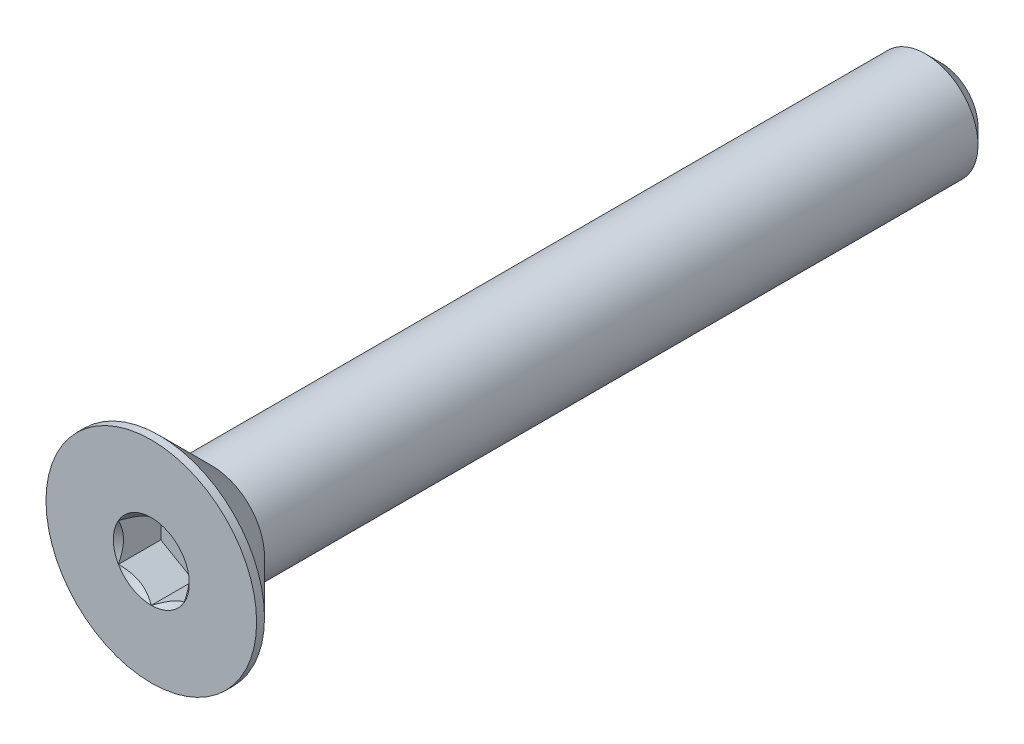
ISO-10303-21;
HEADER;
FILE_DESCRIPTION(('STEP AP214'),'2;1');
FILE_NAME('part.step','',(''),(''),'','','');
FILE_SCHEMA(('AUTOMOTIVE_DESIGN { 1 0 10303 214 1 1 1 1 }'));
ENDSEC;
DATA;
#1=APPLICATION_CONTEXT('core data for automotive mechanical design processes');
#2=APPLICATION_PROTOCOL_DEFINITION('international standard','automotive_design',2000,#1);
#3=PRODUCT_CONTEXT('',#1,'mechanical');
#4=PRODUCT('Part','Part','',(#3));
#5=PRODUCT_RELATED_PRODUCT_CATEGORY('part','',(#4));
#6=PRODUCT_DEFINITION_FORMATION('','',#4);
#7=PRODUCT_DEFINITION_CONTEXT('part definition',#1,'design');
#8=PRODUCT_DEFINITION('design','',#6,#7);
#9=PRODUCT_DEFINITION_SHAPE('','',#8);
#10=(LENGTH_UNIT() NAMED_UNIT(*) SI_UNIT(.MILLI.,.METRE.));
#11=(NAMED_UNIT(*) PLANE_ANGLE_UNIT() SI_UNIT($,.RADIAN.));
#12=(NAMED_UNIT(*) SI_UNIT($,.STERADIAN.) SOLID_ANGLE_UNIT());
#13=UNCERTAINTY_MEASURE_WITH_UNIT(LENGTH_MEASURE(1.E-05),#10,'distance_accuracy_value','');
#14=(GEOMETRIC_REPRESENTATION_CONTEXT(3) GLOBAL_UNCERTAINTY_ASSIGNED_CONTEXT((#13)) GLOBAL_UNIT_ASSIGNED_CONTEXT((#10,
#11,#12)) REPRESENTATION_CONTEXT('',''));
#15=CARTESIAN_POINT('',(0.,0.,0.));
#16=DIRECTION('',(0.,0.,1.));
#17=DIRECTION('',(1.,0.,0.));
#18=AXIS2_PLACEMENT_3D('',#15,#16,#17);
#19=CARTESIAN_POINT('',(0.,0.,-15.));
#20=DIRECTION('',(0.,0.,-1.));
#21=DIRECTION('',(0.,1.,0.));
#22=AXIS2_PLACEMENT_3D('',#19,#20,#21);
#23=CYLINDRICAL_SURFACE('',#22,2.);
#24=CARTESIAN_POINT('',(0.,0.,12.7));
#25=DIRECTION('',(0.,0.,-1.));
#26=DIRECTION('',(0.,1.,0.));
#27=AXIS2_PLACEMENT_3D('',#24,#25,#26);
#28=CIRCLE('',#27,2.);
#29=CARTESIAN_POINT('',(0.,2.,12.7));
#30=VERTEX_POINT('',#29);
#31=EDGE_CURVE('E11',#30,#30,#28,.F.);
#32=ORIENTED_EDGE('',*,*,#31,.F.);
#33=EDGE_LOOP('',(#32));
#34=FACE_BOUND('',#33,.T.);
#35=CARTESIAN_POINT('',(0.,0.,-14.4));
#36=DIRECTION('',(0.,0.,-1.));
#37=DIRECTION('',(0.,1.,0.));
#38=AXIS2_PLACEMENT_3D('',#35,#36,#37);
#39=CIRCLE('',#38,2.);
#40=CARTESIAN_POINT('',(0.,2.,-14.4));
#41=VERTEX_POINT('',#40);
#42=EDGE_CURVE('E43',#41,#41,#39,.F.);
#43=ORIENTED_EDGE('',*,*,#42,.T.);
#44=EDGE_LOOP('',(#43));
#45=FACE_BOUND('',#44,.T.);
#46=ADVANCED_FACE('F35',(#34,#45),#23,.T.);
#47=CARTESIAN_POINT('',(0.,2.,-15.));
#48=DIRECTION('',(0.,0.,-1.));
#49=DIRECTION('',(0.,1.,0.));
#50=AXIS2_PLACEMENT_3D('',#47,#48,#49);
#51=PLANE('',#50);
#52=CARTESIAN_POINT('',(0.,0.,-15.));
#53=DIRECTION('',(0.,0.,-1.));
#54=DIRECTION('',(0.,1.,0.));
#55=AXIS2_PLACEMENT_3D('',#52,#53,#54);
#56=CIRCLE('',#55,1.4);
#57=CARTESIAN_POINT('',(0.,1.40000000000001,-15.));
#58=VERTEX_POINT('',#57);
#59=EDGE_CURVE('E147',#58,#58,#56,.T.);
#60=ORIENTED_EDGE('',*,*,#59,.T.);
#61=EDGE_LOOP('',(#60));
#62=FACE_BOUND('',#61,.T.);
#63=ADVANCED_FACE('F156',(#62),#51,.T.);
#64=CARTESIAN_POINT('',(0.,0.,-15.));
#65=DIRECTION('',(0.,0.,1.));
#66=DIRECTION('',(0.,-1.,0.));
#67=AXIS2_PLACEMENT_3D('',#64,#65,#66);
#68=CONICAL_SURFACE('',#67,1.40000000000001,0.785398163397448);
#69=ORIENTED_EDGE('',*,*,#42,.F.);
#70=EDGE_LOOP('',(#69));
#71=FACE_BOUND('',#70,.T.);
#72=ORIENTED_EDGE('',*,*,#59,.F.);
#73=EDGE_LOOP('',(#72));
#74=FACE_BOUND('',#73,.T.);
#75=ADVANCED_FACE('F37',(#71,#74),#68,.T.);
#76=CARTESIAN_POINT('',(0.,0.,-15.));
#77=DIRECTION('',(0.,0.,-1.));
#78=DIRECTION('',(0.,1.,0.));
#79=AXIS2_PLACEMENT_3D('',#76,#77,#78);
#80=CYLINDRICAL_SURFACE('',#79,4.);
#81=CARTESIAN_POINT('',(0.,0.,15.));
#82=DIRECTION('',(0.,0.,-1.));
#83=DIRECTION('',(0.,1.,0.));
#84=AXIS2_PLACEMENT_3D('',#81,#82,#83);
#85=CIRCLE('',#84,4.);
#86=CARTESIAN_POINT('',(0.,4.,15.));
#87=VERTEX_POINT('',#86);
#88=EDGE_CURVE('E127',#87,#87,#85,.T.);
#89=ORIENTED_EDGE('',*,*,#88,.T.);
#90=EDGE_LOOP('',(#89));
#91=FACE_BOUND('',#90,.T.);
#92=CARTESIAN_POINT('',(0.,0.,14.7));
#93=DIRECTION('',(0.,0.,-1.));
#94=DIRECTION('',(0.,1.,0.));
#95=AXIS2_PLACEMENT_3D('',#92,#93,#94);
#96=CIRCLE('',#95,4.);
#97=CARTESIAN_POINT('',(0.,4.,14.7));
#98=VERTEX_POINT('',#97);
#99=EDGE_CURVE('E124',#98,#98,#96,.T.);
#100=ORIENTED_EDGE('',*,*,#99,.F.);
#101=EDGE_LOOP('',(#100));
#102=FACE_BOUND('',#101,.T.);
#103=ADVANCED_FACE('F155',(#91,#102),#80,.T.);
#104=CARTESIAN_POINT('',(0.,0.,12.7));
#105=DIRECTION('',(0.,0.,1.));
#106=DIRECTION('',(0.,-1.,0.));
#107=AXIS2_PLACEMENT_3D('',#104,#105,#106);
#108=CONICAL_SURFACE('',#107,2.,0.78539816339745);
#109=ORIENTED_EDGE('',*,*,#99,.T.);
#110=EDGE_LOOP('',(#109));
#111=FACE_BOUND('',#110,.T.);
#112=ORIENTED_EDGE('',*,*,#31,.T.);
#113=EDGE_LOOP('',(#112));
#114=FACE_BOUND('',#113,.T.);
#115=ADVANCED_FACE('F169',(#111,#114),#108,.T.);
#116=CARTESIAN_POINT('',(0.,0.,15.));
#117=DIRECTION('',(0.,0.,1.));
#118=DIRECTION('',(0.,-1.,0.));
#119=AXIS2_PLACEMENT_3D('',#116,#117,#118);
#120=PLANE('',#119);
#121=CARTESIAN_POINT('',(0.,0.,15.));
#122=DIRECTION('',(0.,0.,1.));
#123=DIRECTION('',(1.,0.,0.));
#124=AXIS2_PLACEMENT_3D('',#121,#122,#123);
#125=CIRCLE('',#124,1.44337567297406);
#126=CARTESIAN_POINT('',(1.25,0.721687836487035,15.));
#127=VERTEX_POINT('',#126);
#128=CARTESIAN_POINT('',(0.,1.44337567297407,15.));
#129=VERTEX_POINT('',#128);
#130=EDGE_CURVE('E94',#127,#129,#125,.T.);
#131=ORIENTED_EDGE('',*,*,#130,.F.);
#132=CARTESIAN_POINT('',(0.,0.,15.));
#133=DIRECTION('',(0.,0.,1.));
#134=DIRECTION('',(1.,0.,0.));
#135=AXIS2_PLACEMENT_3D('',#132,#133,#134);
#136=CIRCLE('',#135,1.44337567297406);
#137=CARTESIAN_POINT('',(1.24999999999999,-0.72168783648704,15.));
#138=VERTEX_POINT('',#137);
#139=EDGE_CURVE('E106',#138,#127,#136,.T.);
#140=ORIENTED_EDGE('',*,*,#139,.F.);
#141=CARTESIAN_POINT('',(0.,0.,15.));
#142=DIRECTION('',(0.,0.,1.));
#143=DIRECTION('',(1.,0.,0.));
#144=AXIS2_PLACEMENT_3D('',#141,#142,#143);
#145=CIRCLE('',#144,1.44337567297406);
#146=CARTESIAN_POINT('',(0.,-1.44337567297406,15.));
#147=VERTEX_POINT('',#146);
#148=EDGE_CURVE('E240',#147,#138,#145,.T.);
#149=ORIENTED_EDGE('',*,*,#148,.F.);
#150=CARTESIAN_POINT('',(0.,0.,15.));
#151=DIRECTION('',(0.,0.,1.));
#152=DIRECTION('',(1.,0.,0.));
#153=AXIS2_PLACEMENT_3D('',#150,#151,#152);
#154=CIRCLE('',#153,1.44337567297406);
#155=CARTESIAN_POINT('',(-1.25,-0.72168783648702,15.));
#156=VERTEX_POINT('',#155);
#157=EDGE_CURVE('E119',#156,#147,#154,.T.);
#158=ORIENTED_EDGE('',*,*,#157,.F.);
#159=CARTESIAN_POINT('',(0.,0.,15.));
#160=DIRECTION('',(0.,0.,1.));
#161=DIRECTION('',(1.,0.,0.));
#162=AXIS2_PLACEMENT_3D('',#159,#160,#161);
#163=CIRCLE('',#162,1.44337567297406);
#164=CARTESIAN_POINT('',(-1.25,0.721687836487031,15.));
#165=VERTEX_POINT('',#164);
#166=EDGE_CURVE('E241',#165,#156,#163,.T.);
#167=ORIENTED_EDGE('',*,*,#166,.F.);
#168=CARTESIAN_POINT('',(0.,0.,15.));
#169=DIRECTION('',(0.,0.,1.));
#170=DIRECTION('',(1.,0.,0.));
#171=AXIS2_PLACEMENT_3D('',#168,#169,#170);
#172=CIRCLE('',#171,1.44337567297406);
#173=EDGE_CURVE('E109',#129,#165,#172,.T.);
#174=ORIENTED_EDGE('',*,*,#173,.F.);
#175=EDGE_LOOP('',(#131,#140,#149,#158,#167,#174));
#176=FACE_BOUND('',#175,.T.);
#177=ORIENTED_EDGE('',*,*,#88,.F.);
#178=EDGE_LOOP('',(#177));
#179=FACE_BOUND('',#178,.T.);
#180=ADVANCED_FACE('F103',(#176,#179),#120,.T.);
#181=CARTESIAN_POINT('',(1.25,0.721687836487033,13.39));
#182=DIRECTION('',(0.5,0.866025403784439,0.));
#183=DIRECTION('',(-0.866025403784439,0.5,0.));
#184=AXIS2_PLACEMENT_3D('',#181,#182,#183);
#185=PLANE('',#184);
#186=DIRECTION('',(0.,0.,1.));
#187=VECTOR('',#186,1.);
#188=CARTESIAN_POINT('',(1.25,0.721687836487033,13.39));
#189=LINE('',#188,#187);
#190=CARTESIAN_POINT('',(1.25,0.721687836487033,13.39));
#191=VERTEX_POINT('',#190);
#192=EDGE_CURVE('E50',#191,#127,#189,.T.);
#193=ORIENTED_EDGE('',*,*,#192,.T.);
#194=CARTESIAN_POINT('',(-0.000199999999999727,1.4434911430279,15.0001154839091));
#195=CARTESIAN_POINT('',(0.0427751670715868,1.41867941875065,14.9753216680551));
#196=CARTESIAN_POINT('',(0.0864690047459481,1.39345276980743,14.9519837344187));
#197=CARTESIAN_POINT('',(0.175565930841942,1.34201263554194,14.9092520040845));
#198=CARTESIAN_POINT('',(0.220977498357064,1.31579425481276,14.8898819923604));
#199=CARTESIAN_POINT('',(0.31254782093526,1.26292610442246,14.8567004834135));
#200=CARTESIAN_POINT('',(0.358683240175885,1.23628980770471,14.8428055590526));
#201=CARTESIAN_POINT('',(0.451970080407592,1.18243062538509,14.8213972821606));
#202=CARTESIAN_POINT('',(0.499118649136379,1.15520938653761,14.8138679415668));
#203=CARTESIAN_POINT('',(0.580373556887251,1.10829684367467,14.8070744980507));
#204=CARTESIAN_POINT('',(0.614374876627939,1.08866617256958,14.8060685591043));
#205=CARTESIAN_POINT('',(0.682317764432475,1.04943932800611,14.8077614149113));
#206=CARTESIAN_POINT('',(0.716259317655655,1.02984316311599,14.8104610272155));
#207=CARTESIAN_POINT('',(0.783814856457497,0.990839954603501,14.8194089303164));
#208=CARTESIAN_POINT('',(0.817428507286772,0.971433104248773,14.8256605258997));
#209=CARTESIAN_POINT('',(0.88409463821781,0.932943395609908,14.8413756814139));
#210=CARTESIAN_POINT('',(0.917146871030293,0.913860680098303,14.8508406200875));
#211=CARTESIAN_POINT('',(1.00179969160026,0.86498635135457,14.8789313906876));
#212=CARTESIAN_POINT('',(1.05286649242964,0.835502920149077,14.8996701574522));
#213=CARTESIAN_POINT('',(1.15300085411325,0.77769031947591,14.9463871346715));
#214=CARTESIAN_POINT('',(1.20207431157827,0.749357745598418,14.9723482959468));
#215=CARTESIAN_POINT('',(1.2502,0.721572366433195,15.0001154839091));
#216=B_SPLINE_CURVE_WITH_KNOTS('',3,(#194,#195,#196,#197,#198,#199,#200,#201,#202,#203,#204,
#205,#206,#207,#208,#209,#210,#211,#212,#213,#214,#215),.UNSPECIFIED.,.F.,.F.,(4,2,2,2,2,2,2,2,
2,2,4),(0.,0.166533409618303,0.334037607289761,0.498880396489697,0.663307919240273,
0.780963963458824,0.89864597014845,1.01643764860773,1.13427993171549,1.32148652032141,
1.50809158792574),.UNSPECIFIED.);
#217=EDGE_CURVE('E91',#129,#127,#216,.T.);
#218=ORIENTED_EDGE('',*,*,#217,.F.);
#219=DIRECTION('',(0.,0.,1.));
#220=VECTOR('',#219,1.);
#221=CARTESIAN_POINT('',(0.,1.44337567297406,13.39));
#222=LINE('',#221,#220);
#223=CARTESIAN_POINT('',(0.,1.44337567297406,13.39));
#224=VERTEX_POINT('',#223);
#225=EDGE_CURVE('E143',#224,#129,#222,.T.);
#226=ORIENTED_EDGE('',*,*,#225,.F.);
#227=DIRECTION('',(-0.866025403784439,0.5,0.));
#228=VECTOR('',#227,1.);
#229=CARTESIAN_POINT('',(1.25,0.721687836487033,13.39));
#230=LINE('',#229,#228);
#231=EDGE_CURVE('E116',#191,#224,#230,.T.);
#232=ORIENTED_EDGE('',*,*,#231,.F.);
#233=EDGE_LOOP('',(#193,#218,#226,#232));
#234=FACE_BOUND('',#233,.T.);
#235=ADVANCED_FACE('F121',(#234),#185,.F.);
#236=CARTESIAN_POINT('',(1.25,-0.721687836487033,13.39));
#237=DIRECTION('',(1.,0.,0.));
#238=DIRECTION('',(0.,1.,0.));
#239=AXIS2_PLACEMENT_3D('',#236,#237,#238);
#240=PLANE('',#239);
#241=DIRECTION('',(0.,0.,1.));
#242=VECTOR('',#241,1.);
#243=CARTESIAN_POINT('',(1.25,-0.721687836487033,13.39));
#244=LINE('',#243,#242);
#245=CARTESIAN_POINT('',(1.25,-0.721687836487033,13.39));
#246=VERTEX_POINT('',#245);
#247=EDGE_CURVE('E58',#246,#138,#244,.T.);
#248=ORIENTED_EDGE('',*,*,#247,.T.);
#249=CARTESIAN_POINT('',(1.25,-1.43934010808078,15.4629820968923));
#250=CARTESIAN_POINT('',(1.25,-1.40429313005659,15.4365249226329));
#251=CARTESIAN_POINT('',(1.25,-1.369050871356,15.4103271603543));
#252=CARTESIAN_POINT('',(1.25,-1.29809650706311,15.3585575718396));
#253=CARTESIAN_POINT('',(1.25,-1.26238428576496,15.3329859043563));
#254=CARTESIAN_POINT('',(1.25,-1.15390111792708,15.2570059936895));
#255=CARTESIAN_POINT('',(1.25,-1.08031646726265,15.2077402861896));
#256=CARTESIAN_POINT('',(1.25,-0.926012322755098,15.1110258302631));
#257=CARTESIAN_POINT('',(1.25,-0.845125318656149,15.0638412989418));
#258=CARTESIAN_POINT('',(1.25,-0.679311174076603,14.9775307343904));
#259=CARTESIAN_POINT('',(1.25,-0.594398891026688,14.9383775346269));
#260=CARTESIAN_POINT('',(1.25,-0.46694481246074,14.8904772236883));
#261=CARTESIAN_POINT('',(1.25,-0.426289985812821,14.8767294897863));
#262=CARTESIAN_POINT('',(1.25,-0.343998850091267,14.8524979274505));
#263=CARTESIAN_POINT('',(1.25,-0.302362473614961,14.8420143238698));
#264=CARTESIAN_POINT('',(1.25,-0.219052696285664,14.8250301617483));
#265=CARTESIAN_POINT('',(1.25,-0.177393428474498,14.8184613604714));
#266=CARTESIAN_POINT('',(1.25,-0.0936293693401899,14.8094350534578));
#267=CARTESIAN_POINT('',(1.25,-0.0515246558543937,14.8069768409973));
#268=CARTESIAN_POINT('',(1.25,0.0311890576306342,14.8063540620133));
#269=CARTESIAN_POINT('',(1.25,0.0717969625499332,14.8080371168462));
#270=CARTESIAN_POINT('',(1.25,0.152668636885201,14.8152682705979));
#271=CARTESIAN_POINT('',(1.25,0.192932338835362,14.8208171104131));
#272=CARTESIAN_POINT('',(1.25,0.273499879165299,14.835571036465));
#273=CARTESIAN_POINT('',(1.25,0.313792180618516,14.8448381759641));
#274=CARTESIAN_POINT('',(1.25,0.393496413911462,14.8665361784573));
#275=CARTESIAN_POINT('',(1.25,0.432908419115064,14.8789667767306));
#276=CARTESIAN_POINT('',(1.25,0.556992735862303,14.9227793529314));
#277=CARTESIAN_POINT('',(1.25,0.63989892466609,14.959151072876));
#278=CARTESIAN_POINT('',(1.25,0.801816555499706,15.0400191621783));
#279=CARTESIAN_POINT('',(1.25,0.880812666325049,15.084544720912));
#280=CARTESIAN_POINT('',(1.25,1.0317856127975,15.1764048766666));
#281=CARTESIAN_POINT('',(1.25,1.10391618485086,15.2234899339162));
#282=CARTESIAN_POINT('',(1.25,1.21018606043311,15.2962785615985));
#283=CARTESIAN_POINT('',(1.25,1.2451506996938,15.3207980853934));
#284=CARTESIAN_POINT('',(1.25,1.31460220852737,15.3704856367657));
#285=CARTESIAN_POINT('',(1.25,1.34908920596618,15.3956534854155));
#286=CARTESIAN_POINT('',(1.25,1.38337731682912,15.4210901488412));
#287=B_SPLINE_CURVE_WITH_KNOTS('',3,(#249,#250,#251,#252,#253,#254,#255,#256,#257,#258,#259,
#260,#261,#262,#263,#264,#265,#266,#267,#268,#269,#270,#271,#272,#273,#274,#275,#276,#277,#278,
#279,#280,#281,#282,#283,#284,#285,#286),.UNSPECIFIED.,.F.,.F.,(4,2,2,2,2,2,2,2,2,2,2,2,2,2,2,2,
2,2,4),(0.,0.131732960381448,0.263498984161647,0.529042014455829,0.809741926134625,
1.08947609717226,1.21811634272577,1.34676544783901,1.47310084517845,1.59941451973786,
1.72115042167851,1.84290966131736,1.96679153905343,2.09066305366041,2.3614669289601,
2.63325989198492,2.8915466821228,3.01965734507714,3.14773302245629),.UNSPECIFIED.);
#288=EDGE_CURVE('E115',#127,#138,#287,.F.);
#289=ORIENTED_EDGE('',*,*,#288,.F.);
#290=ORIENTED_EDGE('',*,*,#192,.F.);
#291=DIRECTION('',(0.,1.,0.));
#292=VECTOR('',#291,1.);
#293=CARTESIAN_POINT('',(1.25,-0.721687836487033,13.39));
#294=LINE('',#293,#292);
#295=EDGE_CURVE('E132',#246,#191,#294,.T.);
#296=ORIENTED_EDGE('',*,*,#295,.F.);
#297=EDGE_LOOP('',(#248,#289,#290,#296));
#298=FACE_BOUND('',#297,.T.);
#299=ADVANCED_FACE('F118',(#298),#240,.F.);
#300=CARTESIAN_POINT('',(0.,-1.44337567297406,13.39));
#301=DIRECTION('',(0.5,-0.866025403784439,0.));
#302=DIRECTION('',(0.866025403784439,0.5,0.));
#303=AXIS2_PLACEMENT_3D('',#300,#301,#302);
#304=PLANE('',#303);
#305=DIRECTION('',(0.,0.,1.));
#306=VECTOR('',#305,1.);
#307=CARTESIAN_POINT('',(0.,-1.44337567297406,13.39));
#308=LINE('',#307,#306);
#309=CARTESIAN_POINT('',(0.,-1.44337567297406,13.39));
#310=VERTEX_POINT('',#309);
#311=EDGE_CURVE('E129',#310,#147,#308,.T.);
#312=ORIENTED_EDGE('',*,*,#311,.T.);
#313=CARTESIAN_POINT('',(1.2502,-0.721572366433195,15.0001154839091));
#314=CARTESIAN_POINT('',(1.20722483292841,-0.746384090710445,14.9753216680551));
#315=CARTESIAN_POINT('',(1.16353099525405,-0.771610739653665,14.9519837344187));
#316=CARTESIAN_POINT('',(1.07443406915806,-0.823050873919155,14.9092520040845));
#317=CARTESIAN_POINT('',(1.02902250164294,-0.849269254648334,14.8898819923604));
#318=CARTESIAN_POINT('',(0.93745217906474,-0.902137405038636,14.8567004834135));
#319=CARTESIAN_POINT('',(0.891316759824115,-0.928773701756387,14.8428055590527));
#320=CARTESIAN_POINT('',(0.798029919592409,-0.982632884076012,14.8213972821606));
#321=CARTESIAN_POINT('',(0.750881350863622,-1.00985412292348,14.8138679415668));
#322=CARTESIAN_POINT('',(0.66962644311275,-1.05676666578643,14.8070744980507));
#323=CARTESIAN_POINT('',(0.635625123372061,-1.07639733689152,14.8060685591044));
#324=CARTESIAN_POINT('',(0.567682235567525,-1.11562418145499,14.8077614149113));
#325=CARTESIAN_POINT('',(0.533740682344344,-1.1352203463451,14.8104610272155));
#326=CARTESIAN_POINT('',(0.466185143542502,-1.1742235548576,14.8194089303164));
#327=CARTESIAN_POINT('',(0.432571492713227,-1.19363040521233,14.8256605258997));
#328=CARTESIAN_POINT('',(0.365905361782188,-1.23212011385119,14.8413756814139));
#329=CARTESIAN_POINT('',(0.332853128969705,-1.2512028293628,14.8508406200875));
#330=CARTESIAN_POINT('',(0.248200308399736,-1.30007715810653,14.8789313906876));
#331=CARTESIAN_POINT('',(0.197133507570362,-1.32956058931202,14.8996701574522));
#332=CARTESIAN_POINT('',(0.0969991458867454,-1.38737318998519,14.9463871346715));
#333=CARTESIAN_POINT('',(0.0479256884217308,-1.41570576386268,14.9723482959468));
#334=CARTESIAN_POINT('',(-0.000199999999999889,-1.4434911430279,15.0001154839091));
#335=B_SPLINE_CURVE_WITH_KNOTS('',3,(#313,#314,#315,#316,#317,#318,#319,#320,#321,#322,#323,
#324,#325,#326,#327,#328,#329,#330,#331,#332,#333,#334),.UNSPECIFIED.,.F.,.F.,(4,2,2,2,2,2,2,2,
2,2,4),(0.,0.166533409618303,0.33403760728976,0.498880396489696,0.66330791924027,
0.780963963458823,0.898645970148449,1.01643764860773,1.13427993171549,1.32148652032141,
1.50809158792573),.UNSPECIFIED.);
#336=EDGE_CURVE('E238',#138,#147,#335,.T.);
#337=ORIENTED_EDGE('',*,*,#336,.F.);
#338=ORIENTED_EDGE('',*,*,#247,.F.);
#339=DIRECTION('',(0.866025403784439,0.5,0.));
#340=VECTOR('',#339,1.);
#341=CARTESIAN_POINT('',(0.,-1.44337567297406,13.39));
#342=LINE('',#341,#340);
#343=EDGE_CURVE('E230',#310,#246,#342,.T.);
#344=ORIENTED_EDGE('',*,*,#343,.F.);
#345=EDGE_LOOP('',(#312,#337,#338,#344));
#346=FACE_BOUND('',#345,.T.);
#347=ADVANCED_FACE('F195',(#346),#304,.F.);
#348=CARTESIAN_POINT('',(-1.25,-0.721687836487032,13.39));
#349=DIRECTION('',(-0.5,-0.866025403784438,0.));
#350=DIRECTION('',(0.866025403784439,-0.5,0.));
#351=AXIS2_PLACEMENT_3D('',#348,#349,#350);
#352=PLANE('',#351);
#353=DIRECTION('',(0.,0.,1.));
#354=VECTOR('',#353,1.);
#355=CARTESIAN_POINT('',(-1.25,-0.721687836487032,13.39));
#356=LINE('',#355,#354);
#357=CARTESIAN_POINT('',(-1.25,-0.721687836487032,13.39));
#358=VERTEX_POINT('',#357);
#359=EDGE_CURVE('E137',#358,#156,#356,.T.);
#360=ORIENTED_EDGE('',*,*,#359,.T.);
#361=CARTESIAN_POINT('',(0.000199999999999803,-1.4434911430279,15.0001154839091));
#362=CARTESIAN_POINT('',(-0.0427751670715867,-1.41867941875065,14.9753216680551));
#363=CARTESIAN_POINT('',(-0.0864690047459481,-1.39345276980743,14.9519837344187));
#364=CARTESIAN_POINT('',(-0.175565930841942,-1.34201263554194,14.9092520040845));
#365=CARTESIAN_POINT('',(-0.220977498357065,-1.31579425481276,14.8898819923604));
#366=CARTESIAN_POINT('',(-0.312547820935261,-1.26292610442246,14.8567004834135));
#367=CARTESIAN_POINT('',(-0.358683240175887,-1.23628980770471,14.8428055590527));
#368=CARTESIAN_POINT('',(-0.451970080407594,-1.18243062538508,14.8213972821606));
#369=CARTESIAN_POINT('',(-0.499118649136381,-1.15520938653761,14.8138679415668));
#370=CARTESIAN_POINT('',(-0.580373556887254,-1.10829684367467,14.8070744980507));
#371=CARTESIAN_POINT('',(-0.614374876627943,-1.08866617256958,14.8060685591044));
#372=CARTESIAN_POINT('',(-0.68231776443248,-1.04943932800611,14.8077614149113));
#373=CARTESIAN_POINT('',(-0.71625931765566,-1.02984316311599,14.8104610272155));
#374=CARTESIAN_POINT('',(-0.783814856457502,-0.990839954603498,14.8194089303164));
#375=CARTESIAN_POINT('',(-0.817428507286778,-0.97143310424877,14.8256605258997));
#376=CARTESIAN_POINT('',(-0.884094638217816,-0.932943395609904,14.8413756814139));
#377=CARTESIAN_POINT('',(-0.917146871030299,-0.913860680098299,14.8508406200875));
#378=CARTESIAN_POINT('',(-1.00179969160027,-0.864986351354566,14.8789313906876));
#379=CARTESIAN_POINT('',(-1.05286649242964,-0.835502920149075,14.8996701574522));
#380=CARTESIAN_POINT('',(-1.15300085411326,-0.777690319475908,14.9463871346715));
#381=CARTESIAN_POINT('',(-1.20207431157827,-0.749357745598416,14.9723482959468));
#382=CARTESIAN_POINT('',(-1.2502,-0.721572366433195,15.0001154839091));
#383=B_SPLINE_CURVE_WITH_KNOTS('',3,(#361,#362,#363,#364,#365,#366,#367,#368,#369,#370,#371,
#372,#373,#374,#375,#376,#377,#378,#379,#380,#381,#382),.UNSPECIFIED.,.F.,.F.,(4,2,2,2,2,2,2,2,
2,2,4),(0.,0.166533409618304,0.334037607289762,0.4988803964897,0.663307919240276,
0.780963963458829,0.898645970148456,1.01643764860774,1.1342799317155,1.32148652032141,
1.50809158792573),.UNSPECIFIED.);
#384=EDGE_CURVE('E212',#147,#156,#383,.T.);
#385=ORIENTED_EDGE('',*,*,#384,.F.);
#386=ORIENTED_EDGE('',*,*,#311,.F.);
#387=DIRECTION('',(0.866025403784438,-0.5,0.));
#388=VECTOR('',#387,1.);
#389=CARTESIAN_POINT('',(-1.25,-0.721687836487032,13.39));
#390=LINE('',#389,#388);
#391=EDGE_CURVE('E228',#358,#310,#390,.T.);
#392=ORIENTED_EDGE('',*,*,#391,.F.);
#393=EDGE_LOOP('',(#360,#385,#386,#392));
#394=FACE_BOUND('',#393,.T.);
#395=ADVANCED_FACE('F191',(#394),#352,.F.);
#396=CARTESIAN_POINT('',(-1.25,0.721687836487033,13.39));
#397=DIRECTION('',(-1.,0.,0.));
#398=DIRECTION('',(0.,0.,1.));
#399=AXIS2_PLACEMENT_3D('',#396,#397,#398);
#400=PLANE('',#399);
#401=DIRECTION('',(0.,0.,1.));
#402=VECTOR('',#401,1.);
#403=CARTESIAN_POINT('',(-1.25,0.721687836487033,13.39));
#404=LINE('',#403,#402);
#405=CARTESIAN_POINT('',(-1.25,0.721687836487033,13.39));
#406=VERTEX_POINT('',#405);
#407=EDGE_CURVE('E140',#406,#165,#404,.T.);
#408=ORIENTED_EDGE('',*,*,#407,.T.);
#409=CARTESIAN_POINT('',(-1.25,-1.43934010808078,15.4629820968923));
#410=CARTESIAN_POINT('',(-1.25,-1.40429313005659,15.4365249226329));
#411=CARTESIAN_POINT('',(-1.25,-1.36905087135599,15.4103271603543));
#412=CARTESIAN_POINT('',(-1.25,-1.29809650706311,15.3585575718396));
#413=CARTESIAN_POINT('',(-1.25,-1.26238428576496,15.3329859043563));
#414=CARTESIAN_POINT('',(-1.25,-1.15390111792708,15.2570059936895));
#415=CARTESIAN_POINT('',(-1.25,-1.08031646726264,15.2077402861896));
#416=CARTESIAN_POINT('',(-1.25,-0.926012322755095,15.1110258302631));
#417=CARTESIAN_POINT('',(-1.25,-0.845125318656146,15.0638412989418));
#418=CARTESIAN_POINT('',(-1.25,-0.679311174076601,14.9775307343904));
#419=CARTESIAN_POINT('',(-1.25,-0.594398891026686,14.9383775346269));
#420=CARTESIAN_POINT('',(-1.25,-0.466944812460738,14.8904772236883));
#421=CARTESIAN_POINT('',(-1.25,-0.426289985812819,14.8767294897863));
#422=CARTESIAN_POINT('',(-1.25,-0.343998850091264,14.8524979274505));
#423=CARTESIAN_POINT('',(-1.25,-0.302362473614958,14.8420143238698));
#424=CARTESIAN_POINT('',(-1.25,-0.219052696285661,14.8250301617483));
#425=CARTESIAN_POINT('',(-1.25,-0.177393428474495,14.8184613604714));
#426=CARTESIAN_POINT('',(-1.25,-0.0936293693401869,14.8094350534578));
#427=CARTESIAN_POINT('',(-1.25,-0.0515246558543904,14.8069768409973));
#428=CARTESIAN_POINT('',(-1.25,0.0311890576306378,14.8063540620133));
#429=CARTESIAN_POINT('',(-1.25,0.0717969625499368,14.8080371168462));
#430=CARTESIAN_POINT('',(-1.25,0.152668636885204,14.8152682705979));
#431=CARTESIAN_POINT('',(-1.25,0.192932338835365,14.8208171104131));
#432=CARTESIAN_POINT('',(-1.25,0.273499879165302,14.835571036465));
#433=CARTESIAN_POINT('',(-1.25,0.313792180618518,14.8448381759641));
#434=CARTESIAN_POINT('',(-1.25,0.393496413911464,14.8665361784573));
#435=CARTESIAN_POINT('',(-1.25,0.432908419115066,14.8789667767306));
#436=CARTESIAN_POINT('',(-1.25,0.556992735862305,14.9227793529314));
#437=CARTESIAN_POINT('',(-1.25,0.639898924666092,14.959151072876));
#438=CARTESIAN_POINT('',(-1.25,0.801816555499708,15.0400191621783));
#439=CARTESIAN_POINT('',(-1.25,0.880812666325051,15.084544720912));
#440=CARTESIAN_POINT('',(-1.25,1.03178561279751,15.1764048766666));
#441=CARTESIAN_POINT('',(-1.25,1.10391618485086,15.2234899339162));
#442=CARTESIAN_POINT('',(-1.25,1.21018606043311,15.2962785615985));
#443=CARTESIAN_POINT('',(-1.25,1.2451506996938,15.3207980853934));
#444=CARTESIAN_POINT('',(-1.25,1.31460220852737,15.3704856367657));
#445=CARTESIAN_POINT('',(-1.25,1.34908920596619,15.3956534854155));
#446=CARTESIAN_POINT('',(-1.25,1.38337731682912,15.4210901488412));
#447=B_SPLINE_CURVE_WITH_KNOTS('',3,(#409,#410,#411,#412,#413,#414,#415,#416,#417,#418,#419,
#420,#421,#422,#423,#424,#425,#426,#427,#428,#429,#430,#431,#432,#433,#434,#435,#436,#437,#438,
#439,#440,#441,#442,#443,#444,#445,#446),.UNSPECIFIED.,.F.,.F.,(4,2,2,2,2,2,2,2,2,2,2,2,2,2,2,2,
2,2,4),(0.,0.13173296038145,0.263498984161649,0.529042014455831,0.809741926134626,
1.08947609717226,1.21811634272578,1.34676544783902,1.47310084517845,1.59941451973786,
1.72115042167851,1.84290966131736,1.96679153905343,2.09066305366041,2.3614669289601,
2.63325989198493,2.89154668212281,3.01965734507714,3.1477330224563),.UNSPECIFIED.);
#448=EDGE_CURVE('E97',#156,#165,#447,.T.);
#449=ORIENTED_EDGE('',*,*,#448,.F.);
#450=ORIENTED_EDGE('',*,*,#359,.F.);
#451=DIRECTION('',(0.,-1.,0.));
#452=VECTOR('',#451,1.);
#453=CARTESIAN_POINT('',(-1.25,0.721687836487033,13.39));
#454=LINE('',#453,#452);
#455=EDGE_CURVE('E225',#406,#358,#454,.T.);
#456=ORIENTED_EDGE('',*,*,#455,.F.);
#457=EDGE_LOOP('',(#408,#449,#450,#456));
#458=FACE_BOUND('',#457,.T.);
#459=ADVANCED_FACE('F187',(#458),#400,.F.);
#460=CARTESIAN_POINT('',(0.,1.44337567297406,13.39));
#461=DIRECTION('',(-0.5,0.866025403784439,0.));
#462=DIRECTION('',(-0.866025403784439,-0.5,0.));
#463=AXIS2_PLACEMENT_3D('',#460,#461,#462);
#464=PLANE('',#463);
#465=ORIENTED_EDGE('',*,*,#225,.T.);
#466=CARTESIAN_POINT('',(-1.2502,0.721572366433195,15.0001154839091));
#467=CARTESIAN_POINT('',(-1.20722483292841,0.746384090710444,14.9753216680551));
#468=CARTESIAN_POINT('',(-1.16353099525405,0.771610739653665,14.9519837344187));
#469=CARTESIAN_POINT('',(-1.07443406915806,0.823050873919155,14.9092520040845));
#470=CARTESIAN_POINT('',(-1.02902250164293,0.849269254648334,14.8898819923604));
#471=CARTESIAN_POINT('',(-0.937452179064738,0.902137405038637,14.8567004834135));
#472=CARTESIAN_POINT('',(-0.891316759824112,0.928773701756389,14.8428055590527));
#473=CARTESIAN_POINT('',(-0.798029919592405,0.982632884076015,14.8213972821606));
#474=CARTESIAN_POINT('',(-0.750881350863617,1.00985412292349,14.8138679415668));
#475=CARTESIAN_POINT('',(-0.669626443112744,1.05676666578643,14.8070744980507));
#476=CARTESIAN_POINT('',(-0.635625123372056,1.07639733689152,14.8060685591043));
#477=CARTESIAN_POINT('',(-0.56768223556752,1.11562418145499,14.8077614149113));
#478=CARTESIAN_POINT('',(-0.53374068234434,1.13522034634511,14.8104610272155));
#479=CARTESIAN_POINT('',(-0.466185143542498,1.1742235548576,14.8194089303164));
#480=CARTESIAN_POINT('',(-0.432571492713223,1.19363040521233,14.8256605258997));
#481=CARTESIAN_POINT('',(-0.365905361782184,1.23212011385119,14.8413756814139));
#482=CARTESIAN_POINT('',(-0.332853128969702,1.2512028293628,14.8508406200875));
#483=CARTESIAN_POINT('',(-0.248200308399733,1.30007715810653,14.8789313906876));
#484=CARTESIAN_POINT('',(-0.19713350757036,1.32956058931202,14.8996701574522));
#485=CARTESIAN_POINT('',(-0.0969991458867438,1.38737318998519,14.9463871346715));
#486=CARTESIAN_POINT('',(-0.0479256884217296,1.41570576386268,14.9723482959468));
#487=CARTESIAN_POINT('',(0.000200000000000711,1.4434911430279,15.0001154839091));
#488=B_SPLINE_CURVE_WITH_KNOTS('',3,(#466,#467,#468,#469,#470,#471,#472,#473,#474,#475,#476,
#477,#478,#479,#480,#481,#482,#483,#484,#485,#486,#487),.UNSPECIFIED.,.F.,.F.,(4,2,2,2,2,2,2,2,
2,2,4),(0.,0.166533409618305,0.334037607289764,0.498880396489702,0.66330791924028,
0.780963963458831,0.898645970148457,1.01643764860774,1.1342799317155,1.32148652032141,
1.50809158792574),.UNSPECIFIED.);
#489=EDGE_CURVE('E234',#165,#129,#488,.T.);
#490=ORIENTED_EDGE('',*,*,#489,.F.);
#491=ORIENTED_EDGE('',*,*,#407,.F.);
#492=DIRECTION('',(-0.866025403784439,-0.5,0.));
#493=VECTOR('',#492,1.);
#494=CARTESIAN_POINT('',(0.,1.44337567297406,13.39));
#495=LINE('',#494,#493);
#496=EDGE_CURVE('E222',#224,#406,#495,.T.);
#497=ORIENTED_EDGE('',*,*,#496,.F.);
#498=EDGE_LOOP('',(#465,#490,#491,#497));
#499=FACE_BOUND('',#498,.T.);
#500=ADVANCED_FACE('F183',(#499),#464,.F.);
#501=CARTESIAN_POINT('',(0.,0.,13.39));
#502=DIRECTION('',(0.,0.,1.));
#503=DIRECTION('',(1.,0.,0.));
#504=AXIS2_PLACEMENT_3D('',#501,#502,#503);
#505=PLANE('',#504);
#506=ORIENTED_EDGE('',*,*,#231,.T.);
#507=ORIENTED_EDGE('',*,*,#496,.T.);
#508=ORIENTED_EDGE('',*,*,#455,.T.);
#509=ORIENTED_EDGE('',*,*,#391,.T.);
#510=ORIENTED_EDGE('',*,*,#343,.T.);
#511=ORIENTED_EDGE('',*,*,#295,.T.);
#512=EDGE_LOOP('',(#506,#507,#508,#509,#510,#511));
#513=FACE_BOUND('',#512,.T.);
#514=ADVANCED_FACE('F186',(#513),#505,.T.);
#515=CARTESIAN_POINT('',(0.,0.,15.));
#516=DIRECTION('',(0.,0.,1.));
#517=DIRECTION('',(1.,0.,0.));
#518=AXIS2_PLACEMENT_3D('',#515,#516,#517);
#519=CONICAL_SURFACE('',#518,1.44337567297406,0.78539816339745);
#520=ORIENTED_EDGE('',*,*,#489,.T.);
#521=ORIENTED_EDGE('',*,*,#173,.T.);
#522=EDGE_LOOP('',(#520,#521));
#523=FACE_BOUND('',#522,.T.);
#524=ADVANCED_FACE('F202',(#523),#519,.F.);
#525=CARTESIAN_POINT('',(0.,0.,15.));
#526=DIRECTION('',(0.,0.,1.));
#527=DIRECTION('',(1.,0.,0.));
#528=AXIS2_PLACEMENT_3D('',#525,#526,#527);
#529=CONICAL_SURFACE('',#528,1.44337567297406,0.78539816339745);
#530=ORIENTED_EDGE('',*,*,#384,.T.);
#531=ORIENTED_EDGE('',*,*,#157,.T.);
#532=EDGE_LOOP('',(#530,#531));
#533=FACE_BOUND('',#532,.T.);
#534=ADVANCED_FACE('F204',(#533),#529,.F.);
#535=CARTESIAN_POINT('',(0.,0.,15.));
#536=DIRECTION('',(0.,0.,1.));
#537=DIRECTION('',(1.,0.,0.));
#538=AXIS2_PLACEMENT_3D('',#535,#536,#537);
#539=CONICAL_SURFACE('',#538,1.44337567297406,0.78539816339745);
#540=ORIENTED_EDGE('',*,*,#288,.T.);
#541=ORIENTED_EDGE('',*,*,#139,.T.);
#542=EDGE_LOOP('',(#540,#541));
#543=FACE_BOUND('',#542,.T.);
#544=ADVANCED_FACE('F114',(#543),#539,.F.);
#545=CARTESIAN_POINT('',(0.,0.,15.));
#546=DIRECTION('',(0.,0.,1.));
#547=DIRECTION('',(1.,0.,0.));
#548=AXIS2_PLACEMENT_3D('',#545,#546,#547);
#549=CONICAL_SURFACE('',#548,1.44337567297406,0.78539816339745);
#550=ORIENTED_EDGE('',*,*,#336,.T.);
#551=ORIENTED_EDGE('',*,*,#148,.T.);
#552=EDGE_LOOP('',(#550,#551));
#553=FACE_BOUND('',#552,.T.);
#554=ADVANCED_FACE('F253',(#553),#549,.F.);
#555=CARTESIAN_POINT('',(0.,0.,15.));
#556=DIRECTION('',(0.,0.,1.));
#557=DIRECTION('',(1.,0.,0.));
#558=AXIS2_PLACEMENT_3D('',#555,#556,#557);
#559=CONICAL_SURFACE('',#558,1.44337567297406,0.78539816339745);
#560=ORIENTED_EDGE('',*,*,#448,.T.);
#561=ORIENTED_EDGE('',*,*,#166,.T.);
#562=EDGE_LOOP('',(#560,#561));
#563=FACE_BOUND('',#562,.T.);
#564=ADVANCED_FACE('F258',(#563),#559,.F.);
#565=CARTESIAN_POINT('',(0.,0.,15.));
#566=DIRECTION('',(0.,0.,1.));
#567=DIRECTION('',(1.,0.,0.));
#568=AXIS2_PLACEMENT_3D('',#565,#566,#567);
#569=CONICAL_SURFACE('',#568,1.44337567297406,0.78539816339745);
#570=ORIENTED_EDGE('',*,*,#217,.T.);
#571=ORIENTED_EDGE('',*,*,#130,.T.);
#572=EDGE_LOOP('',(#570,#571));
#573=FACE_BOUND('',#572,.T.);
#574=ADVANCED_FACE('F93',(#573),#569,.F.);
#575=CLOSED_SHELL('',(#46,#63,#75,#103,#115,#180,#235,#299,#347,#395,#459,#500,#514,#524,#534,
#544,#554,#564,#574));
#576=MANIFOLD_SOLID_BREP('B2',#575);
#577=ADVANCED_BREP_SHAPE_REPRESENTATION('',(#18,#576),#14);
#578=SHAPE_DEFINITION_REPRESENTATION(#9,#577);
ENDSEC;
END-ISO-10303-21;
